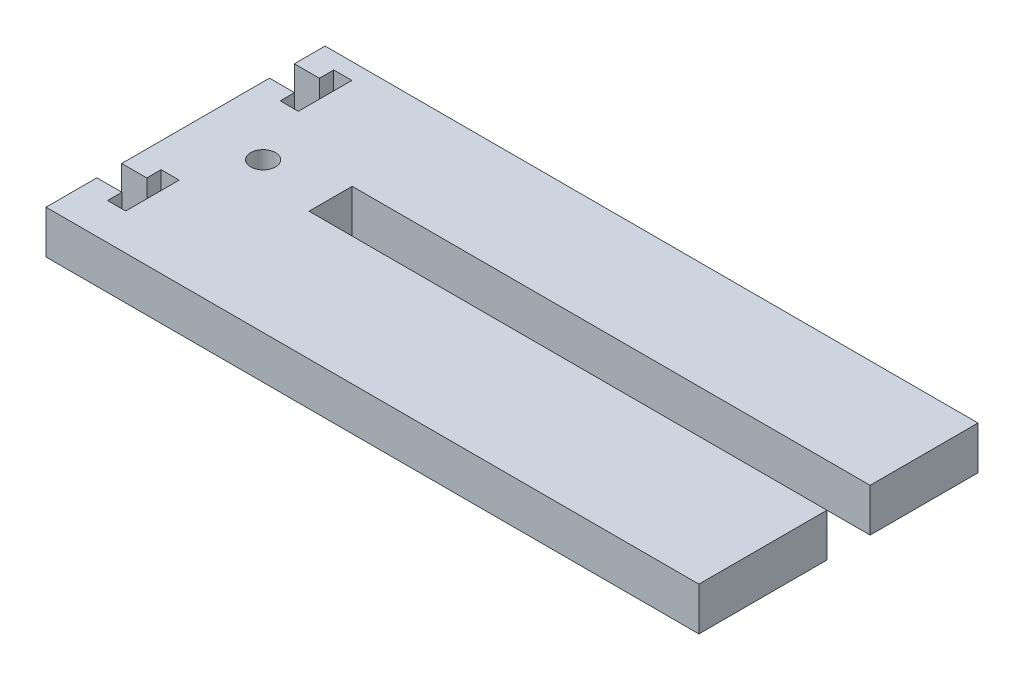
ISO-10303-21;
HEADER;
FILE_DESCRIPTION(('STEP AP214'),'2;1');
FILE_NAME('part.step','',(''),(''),'','','');
FILE_SCHEMA(('AUTOMOTIVE_DESIGN { 1 0 10303 214 1 1 1 1 }'));
ENDSEC;
DATA;
#1=APPLICATION_CONTEXT('core data for automotive mechanical design processes');
#2=APPLICATION_PROTOCOL_DEFINITION('international standard','automotive_design',2000,#1);
#3=PRODUCT_CONTEXT('',#1,'mechanical');
#4=PRODUCT('Part','Part','',(#3));
#5=PRODUCT_RELATED_PRODUCT_CATEGORY('part','',(#4));
#6=PRODUCT_DEFINITION_FORMATION('','',#4);
#7=PRODUCT_DEFINITION_CONTEXT('part definition',#1,'design');
#8=PRODUCT_DEFINITION('design','',#6,#7);
#9=PRODUCT_DEFINITION_SHAPE('','',#8);
#10=(LENGTH_UNIT() NAMED_UNIT(*) SI_UNIT(.MILLI.,.METRE.));
#11=(NAMED_UNIT(*) PLANE_ANGLE_UNIT() SI_UNIT($,.RADIAN.));
#12=(NAMED_UNIT(*) SI_UNIT($,.STERADIAN.) SOLID_ANGLE_UNIT());
#13=UNCERTAINTY_MEASURE_WITH_UNIT(LENGTH_MEASURE(1.E-05),#10,'distance_accuracy_value','');
#14=(GEOMETRIC_REPRESENTATION_CONTEXT(3) GLOBAL_UNCERTAINTY_ASSIGNED_CONTEXT((#13)) GLOBAL_UNIT_ASSIGNED_CONTEXT((#10,
#11,#12)) REPRESENTATION_CONTEXT('',''));
#15=CARTESIAN_POINT('',(0.,0.,0.));
#16=DIRECTION('',(0.,0.,1.));
#17=DIRECTION('',(1.,0.,0.));
#18=AXIS2_PLACEMENT_3D('',#15,#16,#17);
#19=CARTESIAN_POINT('',(-48.0314,-6.35,-42.6212));
#20=DIRECTION('',(-1.,0.,0.));
#21=DIRECTION('',(0.,0.,1.));
#22=AXIS2_PLACEMENT_3D('',#19,#20,#21);
#23=PLANE('',#22);
#24=DIRECTION('',(0.,1.,0.));
#25=VECTOR('',#24,1.);
#26=CARTESIAN_POINT('',(-48.0314,-6.35,-35.137442596542));
#27=LINE('',#26,#25);
#28=CARTESIAN_POINT('',(-48.0314,-6.35,-35.137442596542));
#29=VERTEX_POINT('',#28);
#30=CARTESIAN_POINT('',(-48.0314,0.,-35.137442596542));
#31=VERTEX_POINT('',#30);
#32=EDGE_CURVE('E350',#29,#31,#27,.T.);
#33=ORIENTED_EDGE('',*,*,#32,.T.);
#34=DIRECTION('',(0.,0.,1.));
#35=VECTOR('',#34,1.);
#36=CARTESIAN_POINT('',(-48.0314,0.,-42.6212));
#37=LINE('',#36,#35);
#38=CARTESIAN_POINT('',(-48.0314,0.,-42.6212));
#39=VERTEX_POINT('',#38);
#40=EDGE_CURVE('E295',#39,#31,#37,.T.);
#41=ORIENTED_EDGE('',*,*,#40,.F.);
#42=DIRECTION('',(0.,1.,0.));
#43=VECTOR('',#42,1.);
#44=CARTESIAN_POINT('',(-48.0314,-6.35,-42.6212));
#45=LINE('',#44,#43);
#46=CARTESIAN_POINT('',(-48.0314,-6.35,-42.6212));
#47=VERTEX_POINT('',#46);
#48=EDGE_CURVE('E11',#47,#39,#45,.T.);
#49=ORIENTED_EDGE('',*,*,#48,.F.);
#50=DIRECTION('',(0.,0.,1.));
#51=VECTOR('',#50,1.);
#52=CARTESIAN_POINT('',(-48.0314,-6.35,-42.6212));
#53=LINE('',#52,#51);
#54=EDGE_CURVE('E230',#47,#29,#53,.T.);
#55=ORIENTED_EDGE('',*,*,#54,.T.);
#56=EDGE_LOOP('',(#33,#41,#49,#55));
#57=FACE_BOUND('',#56,.T.);
#58=ADVANCED_FACE('F34',(#57),#23,.T.);
#59=CARTESIAN_POINT('',(-48.0314,-6.35,-42.6212));
#60=DIRECTION('',(0.,0.,-1.));
#61=DIRECTION('',(-1.,0.,0.));
#62=AXIS2_PLACEMENT_3D('',#59,#60,#61);
#63=PLANE('',#62);
#64=DIRECTION('',(-1.,0.,0.));
#65=VECTOR('',#64,1.);
#66=CARTESIAN_POINT('',(-48.0314,0.,-42.6212));
#67=LINE('',#66,#65);
#68=CARTESIAN_POINT('',(-44.3484,0.,-42.6212));
#69=VERTEX_POINT('',#68);
#70=EDGE_CURVE('E292',#69,#39,#67,.T.);
#71=ORIENTED_EDGE('',*,*,#70,.F.);
#72=DIRECTION('',(0.,1.,0.));
#73=VECTOR('',#72,1.);
#74=CARTESIAN_POINT('',(-44.3484,-6.35,-42.6212));
#75=LINE('',#74,#73);
#76=CARTESIAN_POINT('',(-44.3484,-6.35,-42.6212));
#77=VERTEX_POINT('',#76);
#78=EDGE_CURVE('E43',#77,#69,#75,.T.);
#79=ORIENTED_EDGE('',*,*,#78,.F.);
#80=DIRECTION('',(-1.,0.,0.));
#81=VECTOR('',#80,1.);
#82=CARTESIAN_POINT('',(-48.0314,-6.35,-42.6212));
#83=LINE('',#82,#81);
#84=EDGE_CURVE('E220',#77,#47,#83,.T.);
#85=ORIENTED_EDGE('',*,*,#84,.T.);
#86=ORIENTED_EDGE('',*,*,#48,.T.);
#87=EDGE_LOOP('',(#71,#79,#85,#86));
#88=FACE_BOUND('',#87,.T.);
#89=ADVANCED_FACE('F478',(#88),#63,.T.);
#90=CARTESIAN_POINT('',(-44.3484,-6.35,-42.6212));
#91=DIRECTION('',(1.,0.,0.));
#92=DIRECTION('',(0.,0.,-1.));
#93=AXIS2_PLACEMENT_3D('',#90,#91,#92);
#94=PLANE('',#93);
#95=DIRECTION('',(0.,0.,-1.));
#96=VECTOR('',#95,1.);
#97=CARTESIAN_POINT('',(-44.3484,0.,-42.6212));
#98=LINE('',#97,#96);
#99=CARTESIAN_POINT('',(-44.3484,0.,-40.513));
#100=VERTEX_POINT('',#99);
#101=EDGE_CURVE('E206',#100,#69,#98,.T.);
#102=ORIENTED_EDGE('',*,*,#101,.F.);
#103=DIRECTION('',(0.,1.,0.));
#104=VECTOR('',#103,1.);
#105=CARTESIAN_POINT('',(-44.3484,-6.35,-40.513));
#106=LINE('',#105,#104);
#107=CARTESIAN_POINT('',(-44.3484,-6.35,-40.513));
#108=VERTEX_POINT('',#107);
#109=EDGE_CURVE('E201',#108,#100,#106,.T.);
#110=ORIENTED_EDGE('',*,*,#109,.F.);
#111=DIRECTION('',(0.,0.,-1.));
#112=VECTOR('',#111,1.);
#113=CARTESIAN_POINT('',(-44.3484,-6.35,-42.6212));
#114=LINE('',#113,#112);
#115=EDGE_CURVE('E204',#108,#77,#114,.T.);
#116=ORIENTED_EDGE('',*,*,#115,.T.);
#117=ORIENTED_EDGE('',*,*,#78,.T.);
#118=EDGE_LOOP('',(#102,#110,#116,#117));
#119=FACE_BOUND('',#118,.T.);
#120=ADVANCED_FACE('F203',(#119),#94,.T.);
#121=CARTESIAN_POINT('',(-44.3484,-6.35,-40.513));
#122=DIRECTION('',(0.,0.,-1.));
#123=DIRECTION('',(-1.,0.,0.));
#124=AXIS2_PLACEMENT_3D('',#121,#122,#123);
#125=PLANE('',#124);
#126=DIRECTION('',(-1.,0.,0.));
#127=VECTOR('',#126,1.);
#128=CARTESIAN_POINT('',(-44.3484,0.,-40.513));
#129=LINE('',#128,#127);
#130=CARTESIAN_POINT('',(-41.6814,0.,-40.513));
#131=VERTEX_POINT('',#130);
#132=EDGE_CURVE('E289',#131,#100,#129,.T.);
#133=ORIENTED_EDGE('',*,*,#132,.F.);
#134=DIRECTION('',(0.,1.,0.));
#135=VECTOR('',#134,1.);
#136=CARTESIAN_POINT('',(-41.6814,-6.35,-40.513));
#137=LINE('',#136,#135);
#138=CARTESIAN_POINT('',(-41.6814,-6.35,-40.513));
#139=VERTEX_POINT('',#138);
#140=EDGE_CURVE('E211',#139,#131,#137,.T.);
#141=ORIENTED_EDGE('',*,*,#140,.F.);
#142=DIRECTION('',(-1.,0.,0.));
#143=VECTOR('',#142,1.);
#144=CARTESIAN_POINT('',(-44.3484,-6.35,-40.513));
#145=LINE('',#144,#143);
#146=EDGE_CURVE('E218',#139,#108,#145,.T.);
#147=ORIENTED_EDGE('',*,*,#146,.T.);
#148=ORIENTED_EDGE('',*,*,#109,.T.);
#149=EDGE_LOOP('',(#133,#141,#147,#148));
#150=FACE_BOUND('',#149,.T.);
#151=ADVANCED_FACE('F222',(#150),#125,.T.);
#152=CARTESIAN_POINT('',(-41.6814,-6.35,-48.387));
#153=DIRECTION('',(-1.,0.,0.));
#154=DIRECTION('',(0.,0.,1.));
#155=AXIS2_PLACEMENT_3D('',#152,#153,#154);
#156=PLANE('',#155);
#157=DIRECTION('',(0.,0.,1.));
#158=VECTOR('',#157,1.);
#159=CARTESIAN_POINT('',(-41.6814,0.,-48.387));
#160=LINE('',#159,#158);
#161=CARTESIAN_POINT('',(-41.6814,0.,-48.387));
#162=VERTEX_POINT('',#161);
#163=EDGE_CURVE('E286',#162,#131,#160,.T.);
#164=ORIENTED_EDGE('',*,*,#163,.F.);
#165=DIRECTION('',(0.,1.,0.));
#166=VECTOR('',#165,1.);
#167=CARTESIAN_POINT('',(-41.6814,-6.35,-48.387));
#168=LINE('',#167,#166);
#169=CARTESIAN_POINT('',(-41.6814,-6.35,-48.387));
#170=VERTEX_POINT('',#169);
#171=EDGE_CURVE('E300',#170,#162,#168,.T.);
#172=ORIENTED_EDGE('',*,*,#171,.F.);
#173=DIRECTION('',(0.,0.,1.));
#174=VECTOR('',#173,1.);
#175=CARTESIAN_POINT('',(-41.6814,-6.35,-48.387));
#176=LINE('',#175,#174);
#177=EDGE_CURVE('E223',#170,#139,#176,.T.);
#178=ORIENTED_EDGE('',*,*,#177,.T.);
#179=ORIENTED_EDGE('',*,*,#140,.T.);
#180=EDGE_LOOP('',(#164,#172,#178,#179));
#181=FACE_BOUND('',#180,.T.);
#182=ADVANCED_FACE('F491',(#181),#156,.T.);
#183=CARTESIAN_POINT('',(-44.3484,-6.35,-48.387));
#184=DIRECTION('',(0.,0.,1.));
#185=DIRECTION('',(1.,0.,0.));
#186=AXIS2_PLACEMENT_3D('',#183,#184,#185);
#187=PLANE('',#186);
#188=DIRECTION('',(1.,0.,0.));
#189=VECTOR('',#188,1.);
#190=CARTESIAN_POINT('',(-44.3484,0.,-48.387));
#191=LINE('',#190,#189);
#192=CARTESIAN_POINT('',(-44.3484,0.,-48.387));
#193=VERTEX_POINT('',#192);
#194=EDGE_CURVE('E283',#193,#162,#191,.T.);
#195=ORIENTED_EDGE('',*,*,#194,.F.);
#196=DIRECTION('',(0.,1.,0.));
#197=VECTOR('',#196,1.);
#198=CARTESIAN_POINT('',(-44.3484,-6.35,-48.387));
#199=LINE('',#198,#197);
#200=CARTESIAN_POINT('',(-44.3484,-6.35,-48.387));
#201=VERTEX_POINT('',#200);
#202=EDGE_CURVE('E302',#201,#193,#199,.T.);
#203=ORIENTED_EDGE('',*,*,#202,.F.);
#204=DIRECTION('',(1.,0.,0.));
#205=VECTOR('',#204,1.);
#206=CARTESIAN_POINT('',(-44.3484,-6.35,-48.387));
#207=LINE('',#206,#205);
#208=EDGE_CURVE('E225',#201,#170,#207,.T.);
#209=ORIENTED_EDGE('',*,*,#208,.T.);
#210=ORIENTED_EDGE('',*,*,#171,.T.);
#211=EDGE_LOOP('',(#195,#203,#209,#210));
#212=FACE_BOUND('',#211,.T.);
#213=ADVANCED_FACE('F409',(#212),#187,.T.);
#214=CARTESIAN_POINT('',(-44.3484,-6.35,-46.2788));
#215=DIRECTION('',(1.,0.,0.));
#216=DIRECTION('',(0.,0.,-1.));
#217=AXIS2_PLACEMENT_3D('',#214,#215,#216);
#218=PLANE('',#217);
#219=DIRECTION('',(0.,0.,-1.));
#220=VECTOR('',#219,1.);
#221=CARTESIAN_POINT('',(-44.3484,0.,-46.2788));
#222=LINE('',#221,#220);
#223=CARTESIAN_POINT('',(-44.3484,0.,-46.2788));
#224=VERTEX_POINT('',#223);
#225=EDGE_CURVE('E280',#224,#193,#222,.T.);
#226=ORIENTED_EDGE('',*,*,#225,.F.);
#227=DIRECTION('',(0.,1.,0.));
#228=VECTOR('',#227,1.);
#229=CARTESIAN_POINT('',(-44.3484,-6.35,-46.2788));
#230=LINE('',#229,#228);
#231=CARTESIAN_POINT('',(-44.3484,-6.35,-46.2788));
#232=VERTEX_POINT('',#231);
#233=EDGE_CURVE('E304',#232,#224,#230,.T.);
#234=ORIENTED_EDGE('',*,*,#233,.F.);
#235=DIRECTION('',(0.,0.,-1.));
#236=VECTOR('',#235,1.);
#237=CARTESIAN_POINT('',(-44.3484,-6.35,-46.2788));
#238=LINE('',#237,#236);
#239=EDGE_CURVE('E403',#232,#201,#238,.T.);
#240=ORIENTED_EDGE('',*,*,#239,.T.);
#241=ORIENTED_EDGE('',*,*,#202,.T.);
#242=EDGE_LOOP('',(#226,#234,#240,#241));
#243=FACE_BOUND('',#242,.T.);
#244=ADVANCED_FACE('F415',(#243),#218,.T.);
#245=CARTESIAN_POINT('',(-48.0314,-6.35,-46.2788));
#246=DIRECTION('',(0.,0.,1.));
#247=DIRECTION('',(1.,0.,0.));
#248=AXIS2_PLACEMENT_3D('',#245,#246,#247);
#249=PLANE('',#248);
#250=DIRECTION('',(1.,0.,0.));
#251=VECTOR('',#250,1.);
#252=CARTESIAN_POINT('',(-48.0314,0.,-46.2788));
#253=LINE('',#252,#251);
#254=CARTESIAN_POINT('',(-48.0314,0.,-46.2788));
#255=VERTEX_POINT('',#254);
#256=EDGE_CURVE('E277',#255,#224,#253,.T.);
#257=ORIENTED_EDGE('',*,*,#256,.F.);
#258=DIRECTION('',(0.,1.,0.));
#259=VECTOR('',#258,1.);
#260=CARTESIAN_POINT('',(-48.0314,-6.35,-46.2788));
#261=LINE('',#260,#259);
#262=CARTESIAN_POINT('',(-48.0314,-6.35,-46.2788));
#263=VERTEX_POINT('',#262);
#264=EDGE_CURVE('E306',#263,#255,#261,.T.);
#265=ORIENTED_EDGE('',*,*,#264,.F.);
#266=DIRECTION('',(1.,0.,0.));
#267=VECTOR('',#266,1.);
#268=CARTESIAN_POINT('',(-48.0314,-6.35,-46.2788));
#269=LINE('',#268,#267);
#270=EDGE_CURVE('E400',#263,#232,#269,.T.);
#271=ORIENTED_EDGE('',*,*,#270,.T.);
#272=ORIENTED_EDGE('',*,*,#233,.T.);
#273=EDGE_LOOP('',(#257,#265,#271,#272));
#274=FACE_BOUND('',#273,.T.);
#275=ADVANCED_FACE('F418',(#274),#249,.T.);
#276=CARTESIAN_POINT('',(-48.0314,-6.35,-68.0212));
#277=DIRECTION('',(-1.,0.,0.));
#278=DIRECTION('',(0.,0.,1.));
#279=AXIS2_PLACEMENT_3D('',#276,#277,#278);
#280=PLANE('',#279);
#281=DIRECTION('',(0.,0.,1.));
#282=VECTOR('',#281,1.);
#283=CARTESIAN_POINT('',(-48.0314,0.,-68.0212));
#284=LINE('',#283,#282);
#285=CARTESIAN_POINT('',(-48.0314,0.,-68.0212));
#286=VERTEX_POINT('',#285);
#287=EDGE_CURVE('E274',#286,#255,#284,.T.);
#288=ORIENTED_EDGE('',*,*,#287,.F.);
#289=DIRECTION('',(0.,1.,0.));
#290=VECTOR('',#289,1.);
#291=CARTESIAN_POINT('',(-48.0314,-6.35,-68.0212));
#292=LINE('',#291,#290);
#293=CARTESIAN_POINT('',(-48.0314,-6.35,-68.0212));
#294=VERTEX_POINT('',#293);
#295=EDGE_CURVE('E308',#294,#286,#292,.T.);
#296=ORIENTED_EDGE('',*,*,#295,.F.);
#297=DIRECTION('',(0.,0.,1.));
#298=VECTOR('',#297,1.);
#299=CARTESIAN_POINT('',(-48.0314,-6.35,-68.0212));
#300=LINE('',#299,#298);
#301=EDGE_CURVE('E397',#294,#263,#300,.T.);
#302=ORIENTED_EDGE('',*,*,#301,.T.);
#303=ORIENTED_EDGE('',*,*,#264,.T.);
#304=EDGE_LOOP('',(#288,#296,#302,#303));
#305=FACE_BOUND('',#304,.T.);
#306=ADVANCED_FACE('F423',(#305),#280,.T.);
#307=CARTESIAN_POINT('',(-48.0314,-6.35,-68.0212));
#308=DIRECTION('',(0.,0.,-1.));
#309=DIRECTION('',(-1.,0.,0.));
#310=AXIS2_PLACEMENT_3D('',#307,#308,#309);
#311=PLANE('',#310);
#312=DIRECTION('',(-1.,0.,0.));
#313=VECTOR('',#312,1.);
#314=CARTESIAN_POINT('',(-48.0314,0.,-68.0212));
#315=LINE('',#314,#313);
#316=CARTESIAN_POINT('',(-44.3484,0.,-68.0212));
#317=VERTEX_POINT('',#316);
#318=EDGE_CURVE('E271',#317,#286,#315,.T.);
#319=ORIENTED_EDGE('',*,*,#318,.F.);
#320=DIRECTION('',(0.,1.,0.));
#321=VECTOR('',#320,1.);
#322=CARTESIAN_POINT('',(-44.3484,-6.35,-68.0212));
#323=LINE('',#322,#321);
#324=CARTESIAN_POINT('',(-44.3484,-6.35,-68.0212));
#325=VERTEX_POINT('',#324);
#326=EDGE_CURVE('E310',#325,#317,#323,.T.);
#327=ORIENTED_EDGE('',*,*,#326,.F.);
#328=DIRECTION('',(-1.,0.,0.));
#329=VECTOR('',#328,1.);
#330=CARTESIAN_POINT('',(-48.0314,-6.35,-68.0212));
#331=LINE('',#330,#329);
#332=EDGE_CURVE('E394',#325,#294,#331,.T.);
#333=ORIENTED_EDGE('',*,*,#332,.T.);
#334=ORIENTED_EDGE('',*,*,#295,.T.);
#335=EDGE_LOOP('',(#319,#327,#333,#334));
#336=FACE_BOUND('',#335,.T.);
#337=ADVANCED_FACE('F426',(#336),#311,.T.);
#338=CARTESIAN_POINT('',(-44.3484,-6.35,-68.0212));
#339=DIRECTION('',(1.,0.,0.));
#340=DIRECTION('',(0.,0.,-1.));
#341=AXIS2_PLACEMENT_3D('',#338,#339,#340);
#342=PLANE('',#341);
#343=DIRECTION('',(0.,0.,-1.));
#344=VECTOR('',#343,1.);
#345=CARTESIAN_POINT('',(-44.3484,0.,-68.0212));
#346=LINE('',#345,#344);
#347=CARTESIAN_POINT('',(-44.3484,0.,-65.913));
#348=VERTEX_POINT('',#347);
#349=EDGE_CURVE('E268',#348,#317,#346,.T.);
#350=ORIENTED_EDGE('',*,*,#349,.F.);
#351=DIRECTION('',(0.,1.,0.));
#352=VECTOR('',#351,1.);
#353=CARTESIAN_POINT('',(-44.3484,-6.35,-65.913));
#354=LINE('',#353,#352);
#355=CARTESIAN_POINT('',(-44.3484,-6.35,-65.913));
#356=VERTEX_POINT('',#355);
#357=EDGE_CURVE('E312',#356,#348,#354,.T.);
#358=ORIENTED_EDGE('',*,*,#357,.F.);
#359=DIRECTION('',(0.,0.,-1.));
#360=VECTOR('',#359,1.);
#361=CARTESIAN_POINT('',(-44.3484,-6.35,-68.0212));
#362=LINE('',#361,#360);
#363=EDGE_CURVE('E391',#356,#325,#362,.T.);
#364=ORIENTED_EDGE('',*,*,#363,.T.);
#365=ORIENTED_EDGE('',*,*,#326,.T.);
#366=EDGE_LOOP('',(#350,#358,#364,#365));
#367=FACE_BOUND('',#366,.T.);
#368=ADVANCED_FACE('F431',(#367),#342,.T.);
#369=CARTESIAN_POINT('',(-44.3484,-6.35,-65.913));
#370=DIRECTION('',(0.,0.,-1.));
#371=DIRECTION('',(-1.,0.,0.));
#372=AXIS2_PLACEMENT_3D('',#369,#370,#371);
#373=PLANE('',#372);
#374=DIRECTION('',(-1.,0.,0.));
#375=VECTOR('',#374,1.);
#376=CARTESIAN_POINT('',(-44.3484,0.,-65.913));
#377=LINE('',#376,#375);
#378=CARTESIAN_POINT('',(-41.6814,0.,-65.913));
#379=VERTEX_POINT('',#378);
#380=EDGE_CURVE('E265',#379,#348,#377,.T.);
#381=ORIENTED_EDGE('',*,*,#380,.F.);
#382=DIRECTION('',(0.,1.,0.));
#383=VECTOR('',#382,1.);
#384=CARTESIAN_POINT('',(-41.6814,-6.35,-65.913));
#385=LINE('',#384,#383);
#386=CARTESIAN_POINT('',(-41.6814,-6.35,-65.913));
#387=VERTEX_POINT('',#386);
#388=EDGE_CURVE('E314',#387,#379,#385,.T.);
#389=ORIENTED_EDGE('',*,*,#388,.F.);
#390=DIRECTION('',(-1.,0.,0.));
#391=VECTOR('',#390,1.);
#392=CARTESIAN_POINT('',(-44.3484,-6.35,-65.913));
#393=LINE('',#392,#391);
#394=EDGE_CURVE('E388',#387,#356,#393,.T.);
#395=ORIENTED_EDGE('',*,*,#394,.T.);
#396=ORIENTED_EDGE('',*,*,#357,.T.);
#397=EDGE_LOOP('',(#381,#389,#395,#396));
#398=FACE_BOUND('',#397,.T.);
#399=ADVANCED_FACE('F434',(#398),#373,.T.);
#400=CARTESIAN_POINT('',(-41.6814,-6.35,-65.913));
#401=DIRECTION('',(-1.,0.,0.));
#402=DIRECTION('',(0.,0.,1.));
#403=AXIS2_PLACEMENT_3D('',#400,#401,#402);
#404=PLANE('',#403);
#405=DIRECTION('',(0.,0.,1.));
#406=VECTOR('',#405,1.);
#407=CARTESIAN_POINT('',(-41.6814,0.,-65.913));
#408=LINE('',#407,#406);
#409=CARTESIAN_POINT('',(-41.6814,0.,-73.787));
#410=VERTEX_POINT('',#409);
#411=EDGE_CURVE('E262',#410,#379,#408,.T.);
#412=ORIENTED_EDGE('',*,*,#411,.F.);
#413=DIRECTION('',(0.,1.,0.));
#414=VECTOR('',#413,1.);
#415=CARTESIAN_POINT('',(-41.6814,-6.35,-73.787));
#416=LINE('',#415,#414);
#417=CARTESIAN_POINT('',(-41.6814,-6.35,-73.787));
#418=VERTEX_POINT('',#417);
#419=EDGE_CURVE('E316',#418,#410,#416,.T.);
#420=ORIENTED_EDGE('',*,*,#419,.F.);
#421=DIRECTION('',(0.,0.,1.));
#422=VECTOR('',#421,1.);
#423=CARTESIAN_POINT('',(-41.6814,-6.35,-65.913));
#424=LINE('',#423,#422);
#425=EDGE_CURVE('E385',#418,#387,#424,.T.);
#426=ORIENTED_EDGE('',*,*,#425,.T.);
#427=ORIENTED_EDGE('',*,*,#388,.T.);
#428=EDGE_LOOP('',(#412,#420,#426,#427));
#429=FACE_BOUND('',#428,.T.);
#430=ADVANCED_FACE('F439',(#429),#404,.T.);
#431=CARTESIAN_POINT('',(-44.3484,-6.35,-73.787));
#432=DIRECTION('',(0.,0.,1.));
#433=DIRECTION('',(1.,0.,0.));
#434=AXIS2_PLACEMENT_3D('',#431,#432,#433);
#435=PLANE('',#434);
#436=DIRECTION('',(1.,0.,0.));
#437=VECTOR('',#436,1.);
#438=CARTESIAN_POINT('',(-44.3484,0.,-73.787));
#439=LINE('',#438,#437);
#440=CARTESIAN_POINT('',(-44.3484,0.,-73.787));
#441=VERTEX_POINT('',#440);
#442=EDGE_CURVE('E259',#441,#410,#439,.T.);
#443=ORIENTED_EDGE('',*,*,#442,.F.);
#444=DIRECTION('',(0.,1.,0.));
#445=VECTOR('',#444,1.);
#446=CARTESIAN_POINT('',(-44.3484,-6.35,-73.787));
#447=LINE('',#446,#445);
#448=CARTESIAN_POINT('',(-44.3484,-6.35,-73.787));
#449=VERTEX_POINT('',#448);
#450=EDGE_CURVE('E318',#449,#441,#447,.T.);
#451=ORIENTED_EDGE('',*,*,#450,.F.);
#452=DIRECTION('',(1.,0.,0.));
#453=VECTOR('',#452,1.);
#454=CARTESIAN_POINT('',(-44.3484,-6.35,-73.787));
#455=LINE('',#454,#453);
#456=EDGE_CURVE('E382',#449,#418,#455,.T.);
#457=ORIENTED_EDGE('',*,*,#456,.T.);
#458=ORIENTED_EDGE('',*,*,#419,.T.);
#459=EDGE_LOOP('',(#443,#451,#457,#458));
#460=FACE_BOUND('',#459,.T.);
#461=ADVANCED_FACE('F442',(#460),#435,.T.);
#462=CARTESIAN_POINT('',(-44.3484,-6.35,-71.6788));
#463=DIRECTION('',(1.,0.,0.));
#464=DIRECTION('',(0.,0.,-1.));
#465=AXIS2_PLACEMENT_3D('',#462,#463,#464);
#466=PLANE('',#465);
#467=DIRECTION('',(0.,0.,-1.));
#468=VECTOR('',#467,1.);
#469=CARTESIAN_POINT('',(-44.3484,0.,-71.6788));
#470=LINE('',#469,#468);
#471=CARTESIAN_POINT('',(-44.3484,0.,-71.6788));
#472=VERTEX_POINT('',#471);
#473=EDGE_CURVE('E256',#472,#441,#470,.T.);
#474=ORIENTED_EDGE('',*,*,#473,.F.);
#475=DIRECTION('',(0.,1.,0.));
#476=VECTOR('',#475,1.);
#477=CARTESIAN_POINT('',(-44.3484,-6.35,-71.6788));
#478=LINE('',#477,#476);
#479=CARTESIAN_POINT('',(-44.3484,-6.35,-71.6788));
#480=VERTEX_POINT('',#479);
#481=EDGE_CURVE('E320',#480,#472,#478,.T.);
#482=ORIENTED_EDGE('',*,*,#481,.F.);
#483=DIRECTION('',(0.,0.,-1.));
#484=VECTOR('',#483,1.);
#485=CARTESIAN_POINT('',(-44.3484,-6.35,-71.6788));
#486=LINE('',#485,#484);
#487=EDGE_CURVE('E379',#480,#449,#486,.T.);
#488=ORIENTED_EDGE('',*,*,#487,.T.);
#489=ORIENTED_EDGE('',*,*,#450,.T.);
#490=EDGE_LOOP('',(#474,#482,#488,#489));
#491=FACE_BOUND('',#490,.T.);
#492=ADVANCED_FACE('F447',(#491),#466,.T.);
#493=CARTESIAN_POINT('',(-48.0314,-6.35,-71.6788));
#494=DIRECTION('',(0.,0.,1.));
#495=DIRECTION('',(1.,0.,0.));
#496=AXIS2_PLACEMENT_3D('',#493,#494,#495);
#497=PLANE('',#496);
#498=DIRECTION('',(1.,0.,0.));
#499=VECTOR('',#498,1.);
#500=CARTESIAN_POINT('',(-48.0314,0.,-71.6788));
#501=LINE('',#500,#499);
#502=CARTESIAN_POINT('',(-48.0314,0.,-71.6788));
#503=VERTEX_POINT('',#502);
#504=EDGE_CURVE('E253',#503,#472,#501,.T.);
#505=ORIENTED_EDGE('',*,*,#504,.F.);
#506=DIRECTION('',(0.,1.,0.));
#507=VECTOR('',#506,1.);
#508=CARTESIAN_POINT('',(-48.0314,-6.35,-71.6788));
#509=LINE('',#508,#507);
#510=CARTESIAN_POINT('',(-48.0314,-6.35,-71.6788));
#511=VERTEX_POINT('',#510);
#512=EDGE_CURVE('E322',#511,#503,#509,.T.);
#513=ORIENTED_EDGE('',*,*,#512,.F.);
#514=DIRECTION('',(1.,0.,0.));
#515=VECTOR('',#514,1.);
#516=CARTESIAN_POINT('',(-48.0314,-6.35,-71.6788));
#517=LINE('',#516,#515);
#518=EDGE_CURVE('E376',#511,#480,#517,.T.);
#519=ORIENTED_EDGE('',*,*,#518,.T.);
#520=ORIENTED_EDGE('',*,*,#481,.T.);
#521=EDGE_LOOP('',(#505,#513,#519,#520));
#522=FACE_BOUND('',#521,.T.);
#523=ADVANCED_FACE('F450',(#522),#497,.T.);
#524=CARTESIAN_POINT('',(-48.0314,-6.35,-76.2));
#525=DIRECTION('',(-1.,0.,0.));
#526=DIRECTION('',(0.,0.,1.));
#527=AXIS2_PLACEMENT_3D('',#524,#525,#526);
#528=PLANE('',#527);
#529=DIRECTION('',(0.,0.,1.));
#530=VECTOR('',#529,1.);
#531=CARTESIAN_POINT('',(-48.0314,0.,-76.2));
#532=LINE('',#531,#530);
#533=CARTESIAN_POINT('',(-48.0314,0.,-76.2));
#534=VERTEX_POINT('',#533);
#535=EDGE_CURVE('E250',#534,#503,#532,.T.);
#536=ORIENTED_EDGE('',*,*,#535,.F.);
#537=DIRECTION('',(0.,1.,0.));
#538=VECTOR('',#537,1.);
#539=CARTESIAN_POINT('',(-48.0314,-6.35,-76.2));
#540=LINE('',#539,#538);
#541=CARTESIAN_POINT('',(-48.0314,-6.35,-76.2));
#542=VERTEX_POINT('',#541);
#543=EDGE_CURVE('E324',#542,#534,#540,.T.);
#544=ORIENTED_EDGE('',*,*,#543,.F.);
#545=DIRECTION('',(0.,0.,1.));
#546=VECTOR('',#545,1.);
#547=CARTESIAN_POINT('',(-48.0314,-6.35,-76.2));
#548=LINE('',#547,#546);
#549=EDGE_CURVE('E373',#542,#511,#548,.T.);
#550=ORIENTED_EDGE('',*,*,#549,.T.);
#551=ORIENTED_EDGE('',*,*,#512,.T.);
#552=EDGE_LOOP('',(#536,#544,#550,#551));
#553=FACE_BOUND('',#552,.T.);
#554=ADVANCED_FACE('F455',(#553),#528,.T.);
#555=CARTESIAN_POINT('',(-48.0314,-6.35,-76.2));
#556=DIRECTION('',(0.,0.,-1.));
#557=DIRECTION('',(-1.,0.,0.));
#558=AXIS2_PLACEMENT_3D('',#555,#556,#557);
#559=PLANE('',#558);
#560=DIRECTION('',(-1.,0.,0.));
#561=VECTOR('',#560,1.);
#562=CARTESIAN_POINT('',(-48.0314,0.,-76.2));
#563=LINE('',#562,#561);
#564=CARTESIAN_POINT('',(48.0314,0.,-76.2));
#565=VERTEX_POINT('',#564);
#566=EDGE_CURVE('E247',#565,#534,#563,.T.);
#567=ORIENTED_EDGE('',*,*,#566,.F.);
#568=DIRECTION('',(0.,1.,0.));
#569=VECTOR('',#568,1.);
#570=CARTESIAN_POINT('',(48.0314,-6.35,-76.2));
#571=LINE('',#570,#569);
#572=CARTESIAN_POINT('',(48.0314,-6.35,-76.2));
#573=VERTEX_POINT('',#572);
#574=EDGE_CURVE('E326',#573,#565,#571,.T.);
#575=ORIENTED_EDGE('',*,*,#574,.F.);
#576=DIRECTION('',(-1.,0.,0.));
#577=VECTOR('',#576,1.);
#578=CARTESIAN_POINT('',(-48.0314,-6.35,-76.2));
#579=LINE('',#578,#577);
#580=EDGE_CURVE('E370',#573,#542,#579,.T.);
#581=ORIENTED_EDGE('',*,*,#580,.T.);
#582=ORIENTED_EDGE('',*,*,#543,.T.);
#583=EDGE_LOOP('',(#567,#575,#581,#582));
#584=FACE_BOUND('',#583,.T.);
#585=ADVANCED_FACE('F458',(#584),#559,.T.);
#586=CARTESIAN_POINT('',(48.0314,-6.35,-76.2));
#587=DIRECTION('',(1.,0.,0.));
#588=DIRECTION('',(0.,0.,-1.));
#589=AXIS2_PLACEMENT_3D('',#586,#587,#588);
#590=PLANE('',#589);
#591=DIRECTION('',(0.,0.,-1.));
#592=VECTOR('',#591,1.);
#593=CARTESIAN_POINT('',(48.0314,0.,-76.2));
#594=LINE('',#593,#592);
#595=CARTESIAN_POINT('',(48.0314,0.,-60.325));
#596=VERTEX_POINT('',#595);
#597=EDGE_CURVE('E244',#596,#565,#594,.T.);
#598=ORIENTED_EDGE('',*,*,#597,.F.);
#599=DIRECTION('',(0.,1.,0.));
#600=VECTOR('',#599,1.);
#601=CARTESIAN_POINT('',(48.0314,-6.35,-60.325));
#602=LINE('',#601,#600);
#603=CARTESIAN_POINT('',(48.0314,-6.35,-60.325));
#604=VERTEX_POINT('',#603);
#605=EDGE_CURVE('E328',#604,#596,#602,.T.);
#606=ORIENTED_EDGE('',*,*,#605,.F.);
#607=DIRECTION('',(0.,0.,-1.));
#608=VECTOR('',#607,1.);
#609=CARTESIAN_POINT('',(48.0314,-6.35,-76.2));
#610=LINE('',#609,#608);
#611=EDGE_CURVE('E367',#604,#573,#610,.T.);
#612=ORIENTED_EDGE('',*,*,#611,.T.);
#613=ORIENTED_EDGE('',*,*,#574,.T.);
#614=EDGE_LOOP('',(#598,#606,#612,#613));
#615=FACE_BOUND('',#614,.T.);
#616=ADVANCED_FACE('F463',(#615),#590,.T.);
#617=CARTESIAN_POINT('',(48.0314,-6.35,-60.325));
#618=DIRECTION('',(0.,0.,1.));
#619=DIRECTION('',(1.,0.,0.));
#620=AXIS2_PLACEMENT_3D('',#617,#618,#619);
#621=PLANE('',#620);
#622=DIRECTION('',(1.,0.,0.));
#623=VECTOR('',#622,1.);
#624=CARTESIAN_POINT('',(48.0314,0.,-60.325));
#625=LINE('',#624,#623);
#626=CARTESIAN_POINT('',(-28.1686,0.,-60.325));
#627=VERTEX_POINT('',#626);
#628=EDGE_CURVE('E241',#627,#596,#625,.T.);
#629=ORIENTED_EDGE('',*,*,#628,.F.);
#630=DIRECTION('',(0.,1.,0.));
#631=VECTOR('',#630,1.);
#632=CARTESIAN_POINT('',(-28.1686,-6.35,-60.325));
#633=LINE('',#632,#631);
#634=CARTESIAN_POINT('',(-28.1686,-6.35,-60.325));
#635=VERTEX_POINT('',#634);
#636=EDGE_CURVE('E330',#635,#627,#633,.T.);
#637=ORIENTED_EDGE('',*,*,#636,.F.);
#638=DIRECTION('',(1.,0.,0.));
#639=VECTOR('',#638,1.);
#640=CARTESIAN_POINT('',(48.0314,-6.35,-60.325));
#641=LINE('',#640,#639);
#642=EDGE_CURVE('E364',#635,#604,#641,.T.);
#643=ORIENTED_EDGE('',*,*,#642,.T.);
#644=ORIENTED_EDGE('',*,*,#605,.T.);
#645=EDGE_LOOP('',(#629,#637,#643,#644));
#646=FACE_BOUND('',#645,.T.);
#647=ADVANCED_FACE('F466',(#646),#621,.T.);
#648=CARTESIAN_POINT('',(-28.1686,-6.35,-60.325));
#649=DIRECTION('',(1.,0.,0.));
#650=DIRECTION('',(0.,0.,-1.));
#651=AXIS2_PLACEMENT_3D('',#648,#649,#650);
#652=PLANE('',#651);
#653=DIRECTION('',(0.,0.,-1.));
#654=VECTOR('',#653,1.);
#655=CARTESIAN_POINT('',(-28.1686,0.,-60.325));
#656=LINE('',#655,#654);
#657=CARTESIAN_POINT('',(-28.1686,0.,-53.975));
#658=VERTEX_POINT('',#657);
#659=EDGE_CURVE('E238',#658,#627,#656,.T.);
#660=ORIENTED_EDGE('',*,*,#659,.F.);
#661=DIRECTION('',(0.,1.,0.));
#662=VECTOR('',#661,1.);
#663=CARTESIAN_POINT('',(-28.1686,-6.35,-53.975));
#664=LINE('',#663,#662);
#665=CARTESIAN_POINT('',(-28.1686,-6.35,-53.975));
#666=VERTEX_POINT('',#665);
#667=EDGE_CURVE('E331',#666,#658,#664,.T.);
#668=ORIENTED_EDGE('',*,*,#667,.F.);
#669=DIRECTION('',(0.,0.,-1.));
#670=VECTOR('',#669,1.);
#671=CARTESIAN_POINT('',(-28.1686,-6.35,-60.325));
#672=LINE('',#671,#670);
#673=EDGE_CURVE('E361',#666,#635,#672,.T.);
#674=ORIENTED_EDGE('',*,*,#673,.T.);
#675=ORIENTED_EDGE('',*,*,#636,.T.);
#676=EDGE_LOOP('',(#660,#668,#674,#675));
#677=FACE_BOUND('',#676,.T.);
#678=ADVANCED_FACE('F469',(#677),#652,.T.);
#679=CARTESIAN_POINT('',(48.0314,-6.35,-53.975));
#680=DIRECTION('',(0.,0.,-1.));
#681=DIRECTION('',(-1.,0.,0.));
#682=AXIS2_PLACEMENT_3D('',#679,#680,#681);
#683=PLANE('',#682);
#684=DIRECTION('',(-1.,0.,0.));
#685=VECTOR('',#684,1.);
#686=CARTESIAN_POINT('',(48.0314,0.,-53.975));
#687=LINE('',#686,#685);
#688=CARTESIAN_POINT('',(48.0314,0.,-53.975));
#689=VERTEX_POINT('',#688);
#690=EDGE_CURVE('E234',#689,#658,#687,.T.);
#691=ORIENTED_EDGE('',*,*,#690,.F.);
#692=DIRECTION('',(0.,1.,0.));
#693=VECTOR('',#692,1.);
#694=CARTESIAN_POINT('',(48.0314,-6.35,-53.975));
#695=LINE('',#694,#693);
#696=CARTESIAN_POINT('',(48.0314,-6.35,-53.975));
#697=VERTEX_POINT('',#696);
#698=EDGE_CURVE('E38',#697,#689,#695,.T.);
#699=ORIENTED_EDGE('',*,*,#698,.F.);
#700=DIRECTION('',(-1.,0.,0.));
#701=VECTOR('',#700,1.);
#702=CARTESIAN_POINT('',(48.0314,-6.35,-53.975));
#703=LINE('',#702,#701);
#704=EDGE_CURVE('E359',#697,#666,#703,.T.);
#705=ORIENTED_EDGE('',*,*,#704,.T.);
#706=ORIENTED_EDGE('',*,*,#667,.T.);
#707=EDGE_LOOP('',(#691,#699,#705,#706));
#708=FACE_BOUND('',#707,.T.);
#709=ADVANCED_FACE('F338',(#708),#683,.T.);
#710=CARTESIAN_POINT('',(48.0314,-6.35,-53.975));
#711=DIRECTION('',(1.,0.,0.));
#712=DIRECTION('',(0.,0.,-1.));
#713=AXIS2_PLACEMENT_3D('',#710,#711,#712);
#714=PLANE('',#713);
#715=DIRECTION('',(0.,1.,0.));
#716=VECTOR('',#715,1.);
#717=CARTESIAN_POINT('',(48.0314,-6.35,-35.137442596542));
#718=LINE('',#717,#716);
#719=CARTESIAN_POINT('',(48.0314,-6.35,-35.137442596542));
#720=VERTEX_POINT('',#719);
#721=CARTESIAN_POINT('',(48.0314,0.,-35.137442596542));
#722=VERTEX_POINT('',#721);
#723=EDGE_CURVE('E51',#720,#722,#718,.T.);
#724=ORIENTED_EDGE('',*,*,#723,.F.);
#725=DIRECTION('',(0.,0.,-1.));
#726=VECTOR('',#725,1.);
#727=CARTESIAN_POINT('',(48.0314,-6.35,-53.975));
#728=LINE('',#727,#726);
#729=EDGE_CURVE('E139',#720,#697,#728,.T.);
#730=ORIENTED_EDGE('',*,*,#729,.T.);
#731=ORIENTED_EDGE('',*,*,#698,.T.);
#732=DIRECTION('',(0.,0.,-1.));
#733=VECTOR('',#732,1.);
#734=CARTESIAN_POINT('',(48.0314,0.,-53.975));
#735=LINE('',#734,#733);
#736=EDGE_CURVE('E232',#722,#689,#735,.T.);
#737=ORIENTED_EDGE('',*,*,#736,.F.);
#738=EDGE_LOOP('',(#724,#730,#731,#737));
#739=FACE_BOUND('',#738,.T.);
#740=ADVANCED_FACE('F36',(#739),#714,.T.);
#741=CARTESIAN_POINT('',(0.,-6.35,0.));
#742=DIRECTION('',(0.,1.,0.));
#743=DIRECTION('',(0.,0.,1.));
#744=AXIS2_PLACEMENT_3D('',#741,#742,#743);
#745=PLANE('',#744);
#746=CARTESIAN_POINT('',(-38.1,-6.35,-57.15));
#747=DIRECTION('',(0.,1.,0.));
#748=DIRECTION('',(0.,0.,1.));
#749=AXIS2_PLACEMENT_3D('',#746,#747,#748);
#750=CIRCLE('',#749,1.8288);
#751=CARTESIAN_POINT('',(-38.1,-6.35,-55.3212));
#752=VERTEX_POINT('',#751);
#753=EDGE_CURVE('E235',#752,#752,#750,.T.);
#754=ORIENTED_EDGE('',*,*,#753,.T.);
#755=EDGE_LOOP('',(#754));
#756=FACE_BOUND('',#755,.T.);
#757=ORIENTED_EDGE('',*,*,#729,.F.);
#758=DIRECTION('',(-1.,0.,0.));
#759=VECTOR('',#758,1.);
#760=CARTESIAN_POINT('',(48.0314,-6.35,-35.137442596542));
#761=LINE('',#760,#759);
#762=EDGE_CURVE('E345',#720,#29,#761,.T.);
#763=ORIENTED_EDGE('',*,*,#762,.T.);
#764=ORIENTED_EDGE('',*,*,#54,.F.);
#765=ORIENTED_EDGE('',*,*,#84,.F.);
#766=ORIENTED_EDGE('',*,*,#115,.F.);
#767=ORIENTED_EDGE('',*,*,#146,.F.);
#768=ORIENTED_EDGE('',*,*,#177,.F.);
#769=ORIENTED_EDGE('',*,*,#208,.F.);
#770=ORIENTED_EDGE('',*,*,#239,.F.);
#771=ORIENTED_EDGE('',*,*,#270,.F.);
#772=ORIENTED_EDGE('',*,*,#301,.F.);
#773=ORIENTED_EDGE('',*,*,#332,.F.);
#774=ORIENTED_EDGE('',*,*,#363,.F.);
#775=ORIENTED_EDGE('',*,*,#394,.F.);
#776=ORIENTED_EDGE('',*,*,#425,.F.);
#777=ORIENTED_EDGE('',*,*,#456,.F.);
#778=ORIENTED_EDGE('',*,*,#487,.F.);
#779=ORIENTED_EDGE('',*,*,#518,.F.);
#780=ORIENTED_EDGE('',*,*,#549,.F.);
#781=ORIENTED_EDGE('',*,*,#580,.F.);
#782=ORIENTED_EDGE('',*,*,#611,.F.);
#783=ORIENTED_EDGE('',*,*,#642,.F.);
#784=ORIENTED_EDGE('',*,*,#673,.F.);
#785=ORIENTED_EDGE('',*,*,#704,.F.);
#786=EDGE_LOOP('',(#757,#763,#764,#765,#766,#767,#768,#769,#770,#771,#772,#773,#774,#775,#776,
#777,#778,#779,#780,#781,#782,#783,#784,#785));
#787=FACE_BOUND('',#786,.T.);
#788=ADVANCED_FACE('F216',(#756,#787),#745,.F.);
#789=CARTESIAN_POINT('',(0.,0.,0.));
#790=DIRECTION('',(0.,1.,0.));
#791=DIRECTION('',(0.,0.,1.));
#792=AXIS2_PLACEMENT_3D('',#789,#790,#791);
#793=PLANE('',#792);
#794=DIRECTION('',(-1.,0.,0.));
#795=VECTOR('',#794,1.);
#796=CARTESIAN_POINT('',(48.0314,0.,-35.137442596542));
#797=LINE('',#796,#795);
#798=EDGE_CURVE('E342',#722,#31,#797,.T.);
#799=ORIENTED_EDGE('',*,*,#798,.F.);
#800=ORIENTED_EDGE('',*,*,#736,.T.);
#801=ORIENTED_EDGE('',*,*,#690,.T.);
#802=ORIENTED_EDGE('',*,*,#659,.T.);
#803=ORIENTED_EDGE('',*,*,#628,.T.);
#804=ORIENTED_EDGE('',*,*,#597,.T.);
#805=ORIENTED_EDGE('',*,*,#566,.T.);
#806=ORIENTED_EDGE('',*,*,#535,.T.);
#807=ORIENTED_EDGE('',*,*,#504,.T.);
#808=ORIENTED_EDGE('',*,*,#473,.T.);
#809=ORIENTED_EDGE('',*,*,#442,.T.);
#810=ORIENTED_EDGE('',*,*,#411,.T.);
#811=ORIENTED_EDGE('',*,*,#380,.T.);
#812=ORIENTED_EDGE('',*,*,#349,.T.);
#813=ORIENTED_EDGE('',*,*,#318,.T.);
#814=ORIENTED_EDGE('',*,*,#287,.T.);
#815=ORIENTED_EDGE('',*,*,#256,.T.);
#816=ORIENTED_EDGE('',*,*,#225,.T.);
#817=ORIENTED_EDGE('',*,*,#194,.T.);
#818=ORIENTED_EDGE('',*,*,#163,.T.);
#819=ORIENTED_EDGE('',*,*,#132,.T.);
#820=ORIENTED_EDGE('',*,*,#101,.T.);
#821=ORIENTED_EDGE('',*,*,#70,.T.);
#822=ORIENTED_EDGE('',*,*,#40,.T.);
#823=EDGE_LOOP('',(#799,#800,#801,#802,#803,#804,#805,#806,#807,#808,#809,#810,#811,#812,#813,
#814,#815,#816,#817,#818,#819,#820,#821,#822));
#824=FACE_BOUND('',#823,.T.);
#825=CARTESIAN_POINT('',(-38.1,0.,-57.15));
#826=DIRECTION('',(0.,1.,0.));
#827=DIRECTION('',(0.,0.,1.));
#828=AXIS2_PLACEMENT_3D('',#825,#826,#827);
#829=CIRCLE('',#828,1.8288);
#830=CARTESIAN_POINT('',(-38.1,0.,-55.3212));
#831=VERTEX_POINT('',#830);
#832=EDGE_CURVE('E352',#831,#831,#829,.T.);
#833=ORIENTED_EDGE('',*,*,#832,.F.);
#834=EDGE_LOOP('',(#833));
#835=FACE_BOUND('',#834,.T.);
#836=ADVANCED_FACE('F340',(#824,#835),#793,.T.);
#837=CARTESIAN_POINT('',(-38.1,-6.35,-57.15));
#838=DIRECTION('',(0.,1.,0.));
#839=DIRECTION('',(0.,0.,1.));
#840=AXIS2_PLACEMENT_3D('',#837,#838,#839);
#841=CYLINDRICAL_SURFACE('',#840,1.8288);
#842=ORIENTED_EDGE('',*,*,#753,.F.);
#843=EDGE_LOOP('',(#842));
#844=FACE_BOUND('',#843,.T.);
#845=ORIENTED_EDGE('',*,*,#832,.T.);
#846=EDGE_LOOP('',(#845));
#847=FACE_BOUND('',#846,.T.);
#848=ADVANCED_FACE('F547',(#844,#847),#841,.F.);
#849=CARTESIAN_POINT('',(48.0314,-6.35,-35.137442596542));
#850=DIRECTION('',(0.,0.,-1.));
#851=DIRECTION('',(-1.,0.,0.));
#852=AXIS2_PLACEMENT_3D('',#849,#850,#851);
#853=PLANE('',#852);
#854=ORIENTED_EDGE('',*,*,#798,.T.);
#855=ORIENTED_EDGE('',*,*,#32,.F.);
#856=ORIENTED_EDGE('',*,*,#762,.F.);
#857=ORIENTED_EDGE('',*,*,#723,.T.);
#858=EDGE_LOOP('',(#854,#855,#856,#857));
#859=FACE_BOUND('',#858,.T.);
#860=ADVANCED_FACE('F551',(#859),#853,.F.);
#861=CLOSED_SHELL('',(#58,#89,#120,#151,#182,#213,#244,#275,#306,#337,#368,#399,#430,#461,#492,
#523,#554,#585,#616,#647,#678,#709,#740,#788,#836,#848,#860));
#862=MANIFOLD_SOLID_BREP('B2',#861);
#863=ADVANCED_BREP_SHAPE_REPRESENTATION('',(#18,#862),#14);
#864=SHAPE_DEFINITION_REPRESENTATION(#9,#863);
ENDSEC;
END-ISO-10303-21;
